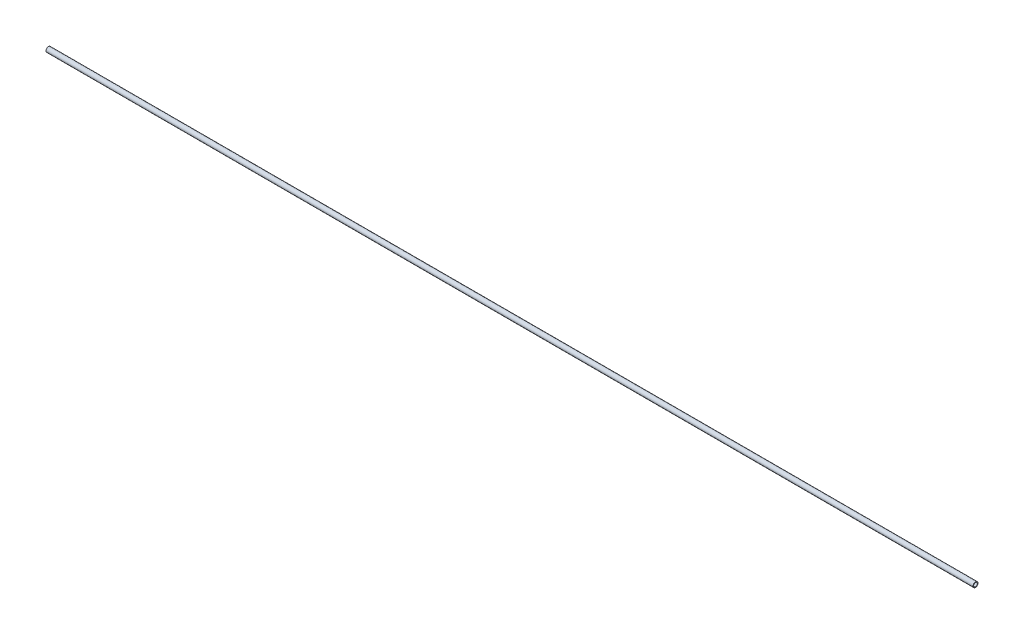
ISO-10303-21;
HEADER;
FILE_DESCRIPTION(('STEP AP214'),'2;1');
FILE_NAME('part.step','',(''),(''),'','','');
FILE_SCHEMA(('AUTOMOTIVE_DESIGN { 1 0 10303 214 1 1 1 1 }'));
ENDSEC;
DATA;
#1=APPLICATION_CONTEXT('core data for automotive mechanical design processes');
#2=APPLICATION_PROTOCOL_DEFINITION('international standard','automotive_design',2000,#1);
#3=PRODUCT_CONTEXT('',#1,'mechanical');
#4=PRODUCT('Part','Part','',(#3));
#5=PRODUCT_RELATED_PRODUCT_CATEGORY('part','',(#4));
#6=PRODUCT_DEFINITION_FORMATION('','',#4);
#7=PRODUCT_DEFINITION_CONTEXT('part definition',#1,'design');
#8=PRODUCT_DEFINITION('design','',#6,#7);
#9=PRODUCT_DEFINITION_SHAPE('','',#8);
#10=(LENGTH_UNIT() NAMED_UNIT(*) SI_UNIT(.MILLI.,.METRE.));
#11=(NAMED_UNIT(*) PLANE_ANGLE_UNIT() SI_UNIT($,.RADIAN.));
#12=(NAMED_UNIT(*) SI_UNIT($,.STERADIAN.) SOLID_ANGLE_UNIT());
#13=UNCERTAINTY_MEASURE_WITH_UNIT(LENGTH_MEASURE(1.E-05),#10,'distance_accuracy_value','');
#14=(GEOMETRIC_REPRESENTATION_CONTEXT(3) GLOBAL_UNCERTAINTY_ASSIGNED_CONTEXT((#13)) GLOBAL_UNIT_ASSIGNED_CONTEXT((#10,
#11,#12)) REPRESENTATION_CONTEXT('',''));
#15=CARTESIAN_POINT('',(0.,0.,0.));
#16=DIRECTION('',(0.,0.,1.));
#17=DIRECTION('',(1.,0.,0.));
#18=AXIS2_PLACEMENT_3D('',#15,#16,#17);
#19=CARTESIAN_POINT('',(1570.,0.,0.));
#20=DIRECTION('',(1.,0.,0.));
#21=DIRECTION('',(0.,0.,-1.));
#22=AXIS2_PLACEMENT_3D('',#19,#20,#21);
#23=PLANE('',#22);
#24=CARTESIAN_POINT('',(1570.,0.,0.));
#25=DIRECTION('',(1.,0.,0.));
#26=DIRECTION('',(0.,0.,-1.));
#27=AXIS2_PLACEMENT_3D('',#24,#25,#26);
#28=CIRCLE('',#27,8.35);
#29=CARTESIAN_POINT('',(1570.,0.,-8.35));
#30=VERTEX_POINT('',#29);
#31=EDGE_CURVE('E10',#30,#30,#28,.T.);
#32=ORIENTED_EDGE('',*,*,#31,.T.);
#33=EDGE_LOOP('',(#32));
#34=FACE_BOUND('',#33,.T.);
#35=CARTESIAN_POINT('',(1570.,0.,0.));
#36=DIRECTION('',(1.,0.,0.));
#37=DIRECTION('',(0.,0.,-1.));
#38=AXIS2_PLACEMENT_3D('',#35,#36,#37);
#39=CIRCLE('',#38,6.35);
#40=CARTESIAN_POINT('',(1570.,0.,-6.35));
#41=VERTEX_POINT('',#40);
#42=EDGE_CURVE('E42',#41,#41,#39,.T.);
#43=ORIENTED_EDGE('',*,*,#42,.F.);
#44=EDGE_LOOP('',(#43));
#45=FACE_BOUND('',#44,.T.);
#46=ADVANCED_FACE('F31',(#34,#45),#23,.T.);
#47=CARTESIAN_POINT('',(-1570.,0.,0.));
#48=DIRECTION('',(1.,0.,0.));
#49=DIRECTION('',(0.,0.,-1.));
#50=AXIS2_PLACEMENT_3D('',#47,#48,#49);
#51=PLANE('',#50);
#52=CARTESIAN_POINT('',(-1570.,0.,0.));
#53=DIRECTION('',(1.,0.,0.));
#54=DIRECTION('',(0.,0.,-1.));
#55=AXIS2_PLACEMENT_3D('',#52,#53,#54);
#56=CIRCLE('',#55,8.35);
#57=CARTESIAN_POINT('',(-1570.,0.,-8.35));
#58=VERTEX_POINT('',#57);
#59=EDGE_CURVE('E35',#58,#58,#56,.T.);
#60=ORIENTED_EDGE('',*,*,#59,.F.);
#61=EDGE_LOOP('',(#60));
#62=FACE_BOUND('',#61,.T.);
#63=CARTESIAN_POINT('',(-1570.,0.,0.));
#64=DIRECTION('',(1.,0.,0.));
#65=DIRECTION('',(0.,0.,-1.));
#66=AXIS2_PLACEMENT_3D('',#63,#64,#65);
#67=CIRCLE('',#66,6.35);
#68=CARTESIAN_POINT('',(-1570.,0.,-6.35));
#69=VERTEX_POINT('',#68);
#70=EDGE_CURVE('E44',#69,#69,#67,.T.);
#71=ORIENTED_EDGE('',*,*,#70,.T.);
#72=EDGE_LOOP('',(#71));
#73=FACE_BOUND('',#72,.T.);
#74=ADVANCED_FACE('F54',(#62,#73),#51,.F.);
#75=CARTESIAN_POINT('',(1570.,0.,0.));
#76=DIRECTION('',(-1.,0.,0.));
#77=DIRECTION('',(0.,0.,1.));
#78=AXIS2_PLACEMENT_3D('',#75,#76,#77);
#79=CYLINDRICAL_SURFACE('',#78,8.35);
#80=ORIENTED_EDGE('',*,*,#31,.F.);
#81=EDGE_LOOP('',(#80));
#82=FACE_BOUND('',#81,.T.);
#83=ORIENTED_EDGE('',*,*,#59,.T.);
#84=EDGE_LOOP('',(#83));
#85=FACE_BOUND('',#84,.T.);
#86=ADVANCED_FACE('F33',(#82,#85),#79,.T.);
#87=CARTESIAN_POINT('',(1570.,0.,0.));
#88=DIRECTION('',(-1.,0.,0.));
#89=DIRECTION('',(0.,0.,1.));
#90=AXIS2_PLACEMENT_3D('',#87,#88,#89);
#91=CYLINDRICAL_SURFACE('',#90,6.35);
#92=ORIENTED_EDGE('',*,*,#42,.T.);
#93=EDGE_LOOP('',(#92));
#94=FACE_BOUND('',#93,.T.);
#95=ORIENTED_EDGE('',*,*,#70,.F.);
#96=EDGE_LOOP('',(#95));
#97=FACE_BOUND('',#96,.T.);
#98=ADVANCED_FACE('F50',(#94,#97),#91,.F.);
#99=CLOSED_SHELL('',(#46,#74,#86,#98));
#100=MANIFOLD_SOLID_BREP('B2',#99);
#101=ADVANCED_BREP_SHAPE_REPRESENTATION('',(#18,#100),#14);
#102=SHAPE_DEFINITION_REPRESENTATION(#9,#101);
ENDSEC;
END-ISO-10303-21;
